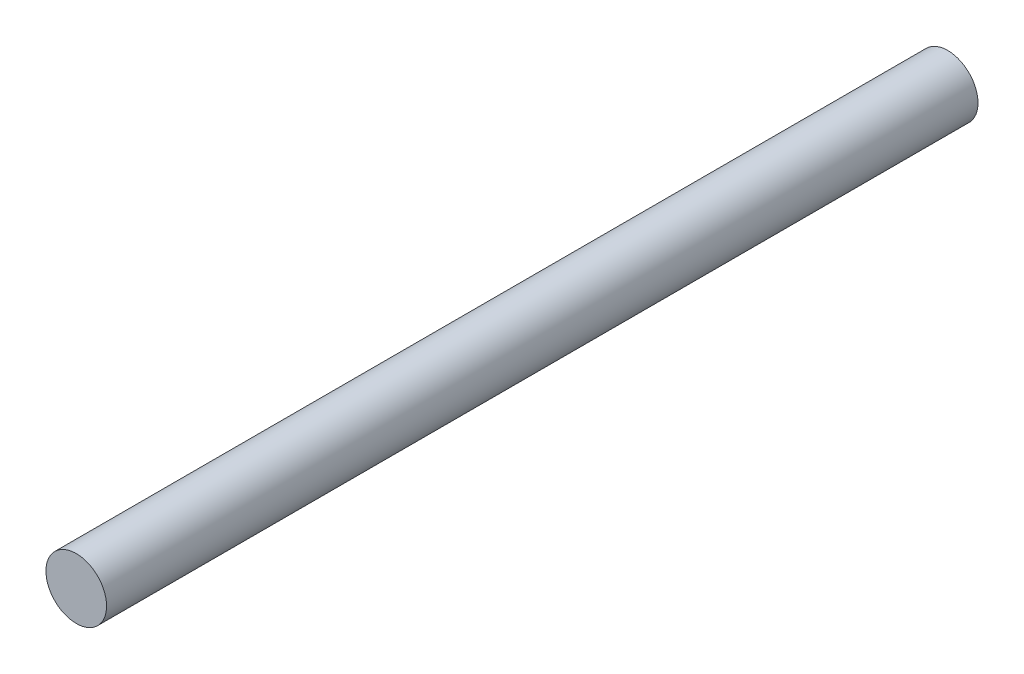
ISO-10303-21;
HEADER;
FILE_DESCRIPTION(('STEP AP214'),'2;1');
FILE_NAME('part.step','',(''),(''),'','','');
FILE_SCHEMA(('AUTOMOTIVE_DESIGN { 1 0 10303 214 1 1 1 1 }'));
ENDSEC;
DATA;
#1=APPLICATION_CONTEXT('core data for automotive mechanical design processes');
#2=APPLICATION_PROTOCOL_DEFINITION('international standard','automotive_design',2000,#1);
#3=PRODUCT_CONTEXT('',#1,'mechanical');
#4=PRODUCT('Part','Part','',(#3));
#5=PRODUCT_RELATED_PRODUCT_CATEGORY('part','',(#4));
#6=PRODUCT_DEFINITION_FORMATION('','',#4);
#7=PRODUCT_DEFINITION_CONTEXT('part definition',#1,'design');
#8=PRODUCT_DEFINITION('design','',#6,#7);
#9=PRODUCT_DEFINITION_SHAPE('','',#8);
#10=(LENGTH_UNIT() NAMED_UNIT(*) SI_UNIT(.MILLI.,.METRE.));
#11=(NAMED_UNIT(*) PLANE_ANGLE_UNIT() SI_UNIT($,.RADIAN.));
#12=(NAMED_UNIT(*) SI_UNIT($,.STERADIAN.) SOLID_ANGLE_UNIT());
#13=UNCERTAINTY_MEASURE_WITH_UNIT(LENGTH_MEASURE(1.E-05),#10,'distance_accuracy_value','');
#14=(GEOMETRIC_REPRESENTATION_CONTEXT(3) GLOBAL_UNCERTAINTY_ASSIGNED_CONTEXT((#13)) GLOBAL_UNIT_ASSIGNED_CONTEXT((#10,
#11,#12)) REPRESENTATION_CONTEXT('',''));
#15=CARTESIAN_POINT('',(0.,0.,0.));
#16=DIRECTION('',(0.,0.,1.));
#17=DIRECTION('',(1.,0.,0.));
#18=AXIS2_PLACEMENT_3D('',#15,#16,#17);
#19=CARTESIAN_POINT('',(0.,0.,115.));
#20=DIRECTION('',(0.,0.,-1.));
#21=DIRECTION('',(-1.,0.,0.));
#22=AXIS2_PLACEMENT_3D('',#19,#20,#21);
#23=CYLINDRICAL_SURFACE('',#22,4.);
#24=CARTESIAN_POINT('',(0.,0.,115.));
#25=DIRECTION('',(0.,0.,1.));
#26=DIRECTION('',(1.,0.,0.));
#27=AXIS2_PLACEMENT_3D('',#24,#25,#26);
#28=CIRCLE('',#27,4.);
#29=CARTESIAN_POINT('',(4.,0.,115.));
#30=VERTEX_POINT('',#29);
#31=EDGE_CURVE('E10',#30,#30,#28,.T.);
#32=ORIENTED_EDGE('',*,*,#31,.F.);
#33=EDGE_LOOP('',(#32));
#34=FACE_BOUND('',#33,.T.);
#35=CARTESIAN_POINT('',(0.,0.,0.));
#36=DIRECTION('',(0.,0.,1.));
#37=DIRECTION('',(1.,0.,0.));
#38=AXIS2_PLACEMENT_3D('',#35,#36,#37);
#39=CIRCLE('',#38,4.);
#40=CARTESIAN_POINT('',(4.,0.,0.));
#41=VERTEX_POINT('',#40);
#42=EDGE_CURVE('E35',#41,#41,#39,.T.);
#43=ORIENTED_EDGE('',*,*,#42,.T.);
#44=EDGE_LOOP('',(#43));
#45=FACE_BOUND('',#44,.T.);
#46=ADVANCED_FACE('F32',(#34,#45),#23,.T.);
#47=CARTESIAN_POINT('',(0.,0.,115.));
#48=DIRECTION('',(0.,0.,1.));
#49=DIRECTION('',(1.,0.,0.));
#50=AXIS2_PLACEMENT_3D('',#47,#48,#49);
#51=PLANE('',#50);
#52=ORIENTED_EDGE('',*,*,#31,.T.);
#53=EDGE_LOOP('',(#52));
#54=FACE_BOUND('',#53,.T.);
#55=ADVANCED_FACE('F47',(#54),#51,.T.);
#56=CARTESIAN_POINT('',(0.,0.,0.));
#57=DIRECTION('',(0.,0.,1.));
#58=DIRECTION('',(1.,0.,0.));
#59=AXIS2_PLACEMENT_3D('',#56,#57,#58);
#60=PLANE('',#59);
#61=ORIENTED_EDGE('',*,*,#42,.F.);
#62=EDGE_LOOP('',(#61));
#63=FACE_BOUND('',#62,.T.);
#64=ADVANCED_FACE('F45',(#63),#60,.F.);
#65=CLOSED_SHELL('',(#46,#55,#64));
#66=MANIFOLD_SOLID_BREP('B2',#65);
#67=ADVANCED_BREP_SHAPE_REPRESENTATION('',(#18,#66),#14);
#68=SHAPE_DEFINITION_REPRESENTATION(#9,#67);
ENDSEC;
END-ISO-10303-21;
